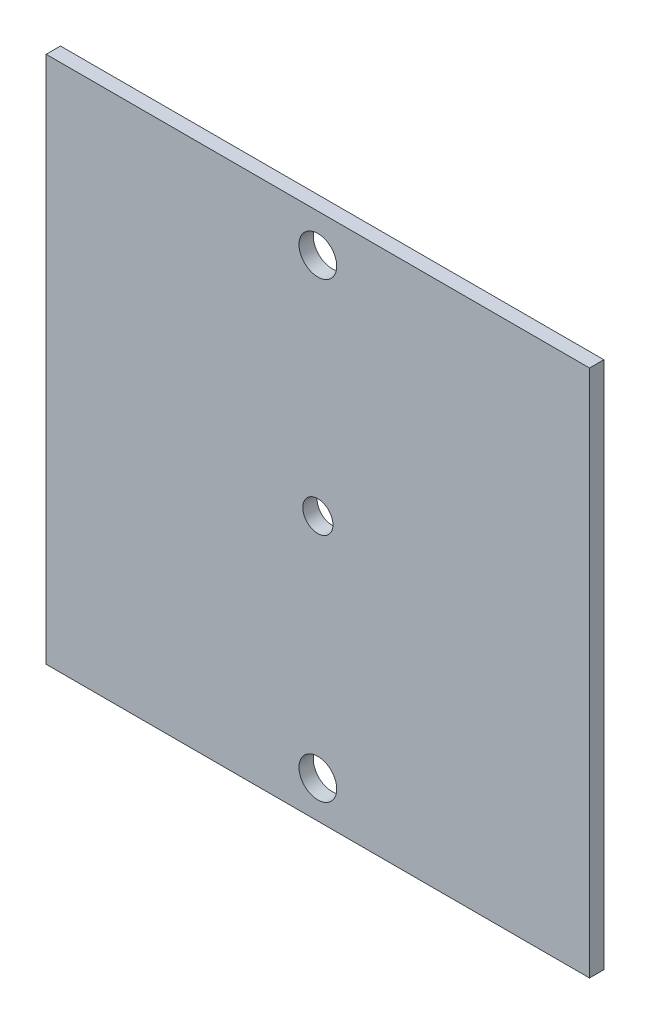
ISO-10303-21;
HEADER;
FILE_DESCRIPTION(('STEP AP214'),'2;1');
FILE_NAME('part.step','',(''),(''),'','','');
FILE_SCHEMA(('AUTOMOTIVE_DESIGN { 1 0 10303 214 1 1 1 1 }'));
ENDSEC;
DATA;
#1=APPLICATION_CONTEXT('core data for automotive mechanical design processes');
#2=APPLICATION_PROTOCOL_DEFINITION('international standard','automotive_design',2000,#1);
#3=PRODUCT_CONTEXT('',#1,'mechanical');
#4=PRODUCT('Part','Part','',(#3));
#5=PRODUCT_RELATED_PRODUCT_CATEGORY('part','',(#4));
#6=PRODUCT_DEFINITION_FORMATION('','',#4);
#7=PRODUCT_DEFINITION_CONTEXT('part definition',#1,'design');
#8=PRODUCT_DEFINITION('design','',#6,#7);
#9=PRODUCT_DEFINITION_SHAPE('','',#8);
#10=(LENGTH_UNIT() NAMED_UNIT(*) SI_UNIT(.MILLI.,.METRE.));
#11=(NAMED_UNIT(*) PLANE_ANGLE_UNIT() SI_UNIT($,.RADIAN.));
#12=(NAMED_UNIT(*) SI_UNIT($,.STERADIAN.) SOLID_ANGLE_UNIT());
#13=UNCERTAINTY_MEASURE_WITH_UNIT(LENGTH_MEASURE(1.E-05),#10,'distance_accuracy_value','');
#14=(GEOMETRIC_REPRESENTATION_CONTEXT(3) GLOBAL_UNCERTAINTY_ASSIGNED_CONTEXT((#13)) GLOBAL_UNIT_ASSIGNED_CONTEXT((#10,
#11,#12)) REPRESENTATION_CONTEXT('',''));
#15=CARTESIAN_POINT('',(0.,0.,0.));
#16=DIRECTION('',(0.,0.,1.));
#17=DIRECTION('',(1.,0.,0.));
#18=AXIS2_PLACEMENT_3D('',#15,#16,#17);
#19=CARTESIAN_POINT('',(-33.6477272727488,65.6912436669771,-1.89738));
#20=DIRECTION('',(-1.,0.,0.));
#21=DIRECTION('',(0.,-1.,0.));
#22=AXIS2_PLACEMENT_3D('',#19,#20,#21);
#23=PLANE('',#22);
#24=DIRECTION('',(0.,-1.,0.));
#25=VECTOR('',#24,1.);
#26=CARTESIAN_POINT('',(-33.6477272727488,65.6912436669771,0.));
#27=LINE('',#26,#25);
#28=CARTESIAN_POINT('',(-33.6477272727488,65.6912436669771,0.));
#29=VERTEX_POINT('',#28);
#30=CARTESIAN_POINT('',(-33.6477272727488,-4.30875633302287,0.));
#31=VERTEX_POINT('',#30);
#32=EDGE_CURVE('E100',#29,#31,#27,.T.);
#33=ORIENTED_EDGE('',*,*,#32,.F.);
#34=DIRECTION('',(0.,0.,1.));
#35=VECTOR('',#34,1.);
#36=CARTESIAN_POINT('',(-33.6477272727488,65.6912436669771,-1.89738));
#37=LINE('',#36,#35);
#38=CARTESIAN_POINT('',(-33.6477272727488,65.6912436669771,-1.89738));
#39=VERTEX_POINT('',#38);
#40=EDGE_CURVE('E11',#39,#29,#37,.T.);
#41=ORIENTED_EDGE('',*,*,#40,.F.);
#42=DIRECTION('',(0.,-1.,0.));
#43=VECTOR('',#42,1.);
#44=CARTESIAN_POINT('',(-33.6477272727488,65.6912436669771,-1.89738));
#45=LINE('',#44,#43);
#46=CARTESIAN_POINT('',(-33.6477272727488,-4.30875633302287,-1.89738));
#47=VERTEX_POINT('',#46);
#48=EDGE_CURVE('E93',#39,#47,#45,.T.);
#49=ORIENTED_EDGE('',*,*,#48,.T.);
#50=DIRECTION('',(0.,0.,1.));
#51=VECTOR('',#50,1.);
#52=CARTESIAN_POINT('',(-33.6477272727488,-4.30875633302287,-1.89738));
#53=LINE('',#52,#51);
#54=EDGE_CURVE('E38',#47,#31,#53,.T.);
#55=ORIENTED_EDGE('',*,*,#54,.T.);
#56=EDGE_LOOP('',(#33,#41,#49,#55));
#57=FACE_BOUND('',#56,.T.);
#58=ADVANCED_FACE('F35',(#57),#23,.T.);
#59=CARTESIAN_POINT('',(-33.6477272727488,65.6912436669771,-1.89738));
#60=DIRECTION('',(0.,1.,0.));
#61=DIRECTION('',(0.,0.,1.));
#62=AXIS2_PLACEMENT_3D('',#59,#60,#61);
#63=PLANE('',#62);
#64=DIRECTION('',(-1.,0.,0.));
#65=VECTOR('',#64,1.);
#66=CARTESIAN_POINT('',(-33.6477272727488,65.6912436669771,0.));
#67=LINE('',#66,#65);
#68=CARTESIAN_POINT('',(38.3522727272512,65.6912436669771,0.));
#69=VERTEX_POINT('',#68);
#70=EDGE_CURVE('E95',#69,#29,#67,.T.);
#71=ORIENTED_EDGE('',*,*,#70,.F.);
#72=DIRECTION('',(0.,0.,1.));
#73=VECTOR('',#72,1.);
#74=CARTESIAN_POINT('',(38.3522727272512,65.6912436669771,-1.89738));
#75=LINE('',#74,#73);
#76=CARTESIAN_POINT('',(38.3522727272512,65.6912436669771,-1.89738));
#77=VERTEX_POINT('',#76);
#78=EDGE_CURVE('E44',#77,#69,#75,.T.);
#79=ORIENTED_EDGE('',*,*,#78,.F.);
#80=DIRECTION('',(-1.,0.,0.));
#81=VECTOR('',#80,1.);
#82=CARTESIAN_POINT('',(-33.6477272727488,65.6912436669771,-1.89738));
#83=LINE('',#82,#81);
#84=EDGE_CURVE('E90',#77,#39,#83,.T.);
#85=ORIENTED_EDGE('',*,*,#84,.T.);
#86=ORIENTED_EDGE('',*,*,#40,.T.);
#87=EDGE_LOOP('',(#71,#79,#85,#86));
#88=FACE_BOUND('',#87,.T.);
#89=ADVANCED_FACE('F111',(#88),#63,.T.);
#90=CARTESIAN_POINT('',(38.3522727272512,65.6912436669771,-1.89738));
#91=DIRECTION('',(1.,0.,0.));
#92=DIRECTION('',(0.,1.,0.));
#93=AXIS2_PLACEMENT_3D('',#90,#91,#92);
#94=PLANE('',#93);
#95=DIRECTION('',(0.,1.,0.));
#96=VECTOR('',#95,1.);
#97=CARTESIAN_POINT('',(38.3522727272512,65.6912436669771,0.));
#98=LINE('',#97,#96);
#99=CARTESIAN_POINT('',(38.3522727272512,-4.30875633302287,0.));
#100=VERTEX_POINT('',#99);
#101=EDGE_CURVE('E85',#100,#69,#98,.T.);
#102=ORIENTED_EDGE('',*,*,#101,.F.);
#103=DIRECTION('',(0.,0.,1.));
#104=VECTOR('',#103,1.);
#105=CARTESIAN_POINT('',(38.3522727272512,-4.30875633302287,-1.89738));
#106=LINE('',#105,#104);
#107=CARTESIAN_POINT('',(38.3522727272512,-4.30875633302287,-1.89738));
#108=VERTEX_POINT('',#107);
#109=EDGE_CURVE('E80',#108,#100,#106,.T.);
#110=ORIENTED_EDGE('',*,*,#109,.F.);
#111=DIRECTION('',(0.,1.,0.));
#112=VECTOR('',#111,1.);
#113=CARTESIAN_POINT('',(38.3522727272512,65.6912436669771,-1.89738));
#114=LINE('',#113,#112);
#115=EDGE_CURVE('E83',#108,#77,#114,.T.);
#116=ORIENTED_EDGE('',*,*,#115,.T.);
#117=ORIENTED_EDGE('',*,*,#78,.T.);
#118=EDGE_LOOP('',(#102,#110,#116,#117));
#119=FACE_BOUND('',#118,.T.);
#120=ADVANCED_FACE('F82',(#119),#94,.T.);
#121=CARTESIAN_POINT('',(-33.6477272727488,-4.30875633302287,-1.89738));
#122=DIRECTION('',(0.,-1.,0.));
#123=DIRECTION('',(0.,0.,-1.));
#124=AXIS2_PLACEMENT_3D('',#121,#122,#123);
#125=PLANE('',#124);
#126=DIRECTION('',(1.,0.,0.));
#127=VECTOR('',#126,1.);
#128=CARTESIAN_POINT('',(-33.6477272727488,-4.30875633302287,0.));
#129=LINE('',#128,#127);
#130=EDGE_CURVE('E103',#31,#100,#129,.T.);
#131=ORIENTED_EDGE('',*,*,#130,.F.);
#132=ORIENTED_EDGE('',*,*,#54,.F.);
#133=DIRECTION('',(1.,0.,0.));
#134=VECTOR('',#133,1.);
#135=CARTESIAN_POINT('',(-33.6477272727488,-4.30875633302287,-1.89738));
#136=LINE('',#135,#134);
#137=EDGE_CURVE('E89',#47,#108,#136,.T.);
#138=ORIENTED_EDGE('',*,*,#137,.T.);
#139=ORIENTED_EDGE('',*,*,#109,.T.);
#140=EDGE_LOOP('',(#131,#132,#138,#139));
#141=FACE_BOUND('',#140,.T.);
#142=ADVANCED_FACE('F92',(#141),#125,.T.);
#143=CARTESIAN_POINT('',(0.,0.,-1.89738));
#144=DIRECTION('',(0.,0.,1.));
#145=DIRECTION('',(1.,0.,0.));
#146=AXIS2_PLACEMENT_3D('',#143,#144,#145);
#147=PLANE('',#146);
#148=CARTESIAN_POINT('',(2.3546477459346,30.6912436669771,-1.89738));
#149=DIRECTION('',(0.,0.,1.));
#150=DIRECTION('',(1.,0.,0.));
#151=AXIS2_PLACEMENT_3D('',#148,#149,#150);
#152=CIRCLE('',#151,2.);
#153=CARTESIAN_POINT('',(4.3546477459346,30.6912436669771,-1.89738));
#154=VERTEX_POINT('',#153);
#155=EDGE_CURVE('E151',#154,#154,#152,.T.);
#156=ORIENTED_EDGE('',*,*,#155,.T.);
#157=EDGE_LOOP('',(#156));
#158=FACE_BOUND('',#157,.T.);
#159=CARTESIAN_POINT('',(2.3546477459316,0.626948243807102,-1.89738));
#160=DIRECTION('',(0.,0.,1.));
#161=DIRECTION('',(1.,0.,0.));
#162=AXIS2_PLACEMENT_3D('',#159,#160,#161);
#163=CIRCLE('',#162,2.5);
#164=CARTESIAN_POINT('',(4.8546477459316,0.626948243807102,-1.89738));
#165=VERTEX_POINT('',#164);
#166=EDGE_CURVE('E155',#165,#165,#163,.T.);
#167=ORIENTED_EDGE('',*,*,#166,.T.);
#168=EDGE_LOOP('',(#167));
#169=FACE_BOUND('',#168,.T.);
#170=CARTESIAN_POINT('',(2.3546477459346,60.6269482438072,-1.89738));
#171=DIRECTION('',(0.,0.,1.));
#172=DIRECTION('',(1.,0.,0.));
#173=AXIS2_PLACEMENT_3D('',#170,#171,#172);
#174=CIRCLE('',#173,2.5);
#175=CARTESIAN_POINT('',(4.8546477459346,60.6269482438072,-1.89738));
#176=VERTEX_POINT('',#175);
#177=EDGE_CURVE('E104',#176,#176,#174,.T.);
#178=ORIENTED_EDGE('',*,*,#177,.T.);
#179=EDGE_LOOP('',(#178));
#180=FACE_BOUND('',#179,.T.);
#181=ORIENTED_EDGE('',*,*,#48,.F.);
#182=ORIENTED_EDGE('',*,*,#84,.F.);
#183=ORIENTED_EDGE('',*,*,#115,.F.);
#184=ORIENTED_EDGE('',*,*,#137,.F.);
#185=EDGE_LOOP('',(#181,#182,#183,#184));
#186=FACE_BOUND('',#185,.T.);
#187=ADVANCED_FACE('F88',(#158,#169,#180,#186),#147,.F.);
#188=CARTESIAN_POINT('',(0.,0.,0.));
#189=DIRECTION('',(0.,0.,1.));
#190=DIRECTION('',(1.,0.,0.));
#191=AXIS2_PLACEMENT_3D('',#188,#189,#190);
#192=PLANE('',#191);
#193=CARTESIAN_POINT('',(2.3546477459346,30.6912436669771,0.));
#194=DIRECTION('',(0.,0.,1.));
#195=DIRECTION('',(1.,0.,0.));
#196=AXIS2_PLACEMENT_3D('',#193,#194,#195);
#197=CIRCLE('',#196,2.);
#198=CARTESIAN_POINT('',(4.3546477459346,30.6912436669771,0.));
#199=VERTEX_POINT('',#198);
#200=EDGE_CURVE('E149',#199,#199,#197,.T.);
#201=ORIENTED_EDGE('',*,*,#200,.F.);
#202=EDGE_LOOP('',(#201));
#203=FACE_BOUND('',#202,.T.);
#204=CARTESIAN_POINT('',(2.3546477459316,0.626948243807102,0.));
#205=DIRECTION('',(0.,0.,1.));
#206=DIRECTION('',(1.,0.,0.));
#207=AXIS2_PLACEMENT_3D('',#204,#205,#206);
#208=CIRCLE('',#207,2.5);
#209=CARTESIAN_POINT('',(4.8546477459316,0.626948243807102,0.));
#210=VERTEX_POINT('',#209);
#211=EDGE_CURVE('E152',#210,#210,#208,.T.);
#212=ORIENTED_EDGE('',*,*,#211,.F.);
#213=EDGE_LOOP('',(#212));
#214=FACE_BOUND('',#213,.T.);
#215=CARTESIAN_POINT('',(2.3546477459346,60.6269482438072,0.));
#216=DIRECTION('',(0.,0.,1.));
#217=DIRECTION('',(1.,0.,0.));
#218=AXIS2_PLACEMENT_3D('',#215,#216,#217);
#219=CIRCLE('',#218,2.5);
#220=CARTESIAN_POINT('',(4.8546477459346,60.6269482438072,0.));
#221=VERTEX_POINT('',#220);
#222=EDGE_CURVE('E161',#221,#221,#219,.T.);
#223=ORIENTED_EDGE('',*,*,#222,.F.);
#224=EDGE_LOOP('',(#223));
#225=FACE_BOUND('',#224,.T.);
#226=ORIENTED_EDGE('',*,*,#32,.T.);
#227=ORIENTED_EDGE('',*,*,#130,.T.);
#228=ORIENTED_EDGE('',*,*,#101,.T.);
#229=ORIENTED_EDGE('',*,*,#70,.T.);
#230=EDGE_LOOP('',(#226,#227,#228,#229));
#231=FACE_BOUND('',#230,.T.);
#232=ADVANCED_FACE('F110',(#203,#214,#225,#231),#192,.T.);
#233=CARTESIAN_POINT('',(2.3546477459346,60.6269482438072,-2.));
#234=DIRECTION('',(0.,0.,1.));
#235=DIRECTION('',(1.,0.,0.));
#236=AXIS2_PLACEMENT_3D('',#233,#234,#235);
#237=CYLINDRICAL_SURFACE('',#236,2.5);
#238=ORIENTED_EDGE('',*,*,#222,.T.);
#239=EDGE_LOOP('',(#238));
#240=FACE_BOUND('',#239,.T.);
#241=ORIENTED_EDGE('',*,*,#177,.F.);
#242=EDGE_LOOP('',(#241));
#243=FACE_BOUND('',#242,.T.);
#244=ADVANCED_FACE('F129',(#240,#243),#237,.F.);
#245=CARTESIAN_POINT('',(2.3546477459316,0.626948243807102,-2.));
#246=DIRECTION('',(0.,0.,1.));
#247=DIRECTION('',(1.,0.,0.));
#248=AXIS2_PLACEMENT_3D('',#245,#246,#247);
#249=CYLINDRICAL_SURFACE('',#248,2.5);
#250=ORIENTED_EDGE('',*,*,#211,.T.);
#251=EDGE_LOOP('',(#250));
#252=FACE_BOUND('',#251,.T.);
#253=ORIENTED_EDGE('',*,*,#166,.F.);
#254=EDGE_LOOP('',(#253));
#255=FACE_BOUND('',#254,.T.);
#256=ADVANCED_FACE('F136',(#252,#255),#249,.F.);
#257=CARTESIAN_POINT('',(2.3546477459346,30.6912436669771,-2.));
#258=DIRECTION('',(0.,0.,1.));
#259=DIRECTION('',(1.,0.,0.));
#260=AXIS2_PLACEMENT_3D('',#257,#258,#259);
#261=CYLINDRICAL_SURFACE('',#260,2.);
#262=ORIENTED_EDGE('',*,*,#200,.T.);
#263=EDGE_LOOP('',(#262));
#264=FACE_BOUND('',#263,.T.);
#265=ORIENTED_EDGE('',*,*,#155,.F.);
#266=EDGE_LOOP('',(#265));
#267=FACE_BOUND('',#266,.T.);
#268=ADVANCED_FACE('F140',(#264,#267),#261,.F.);
#269=CLOSED_SHELL('',(#58,#89,#120,#142,#187,#232,#244,#256,#268));
#270=MANIFOLD_SOLID_BREP('B2',#269);
#271=ADVANCED_BREP_SHAPE_REPRESENTATION('',(#18,#270),#14);
#272=SHAPE_DEFINITION_REPRESENTATION(#9,#271);
ENDSEC;
END-ISO-10303-21;
